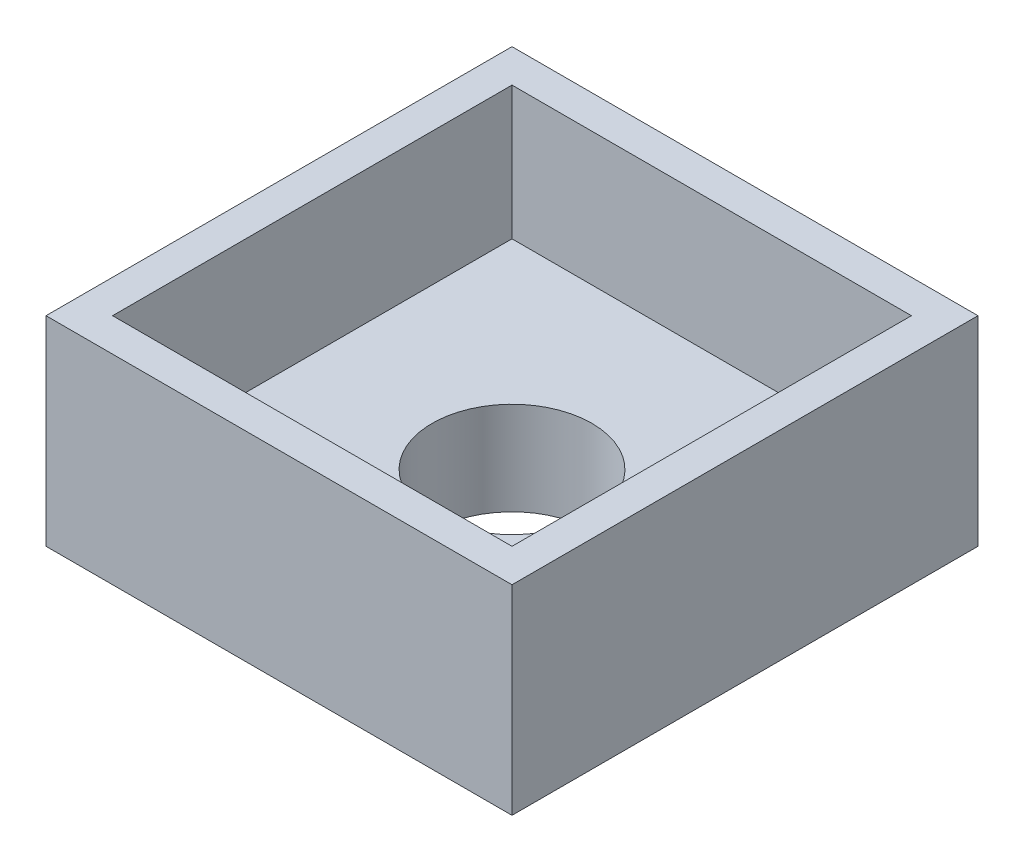
ISO-10303-21;
HEADER;
FILE_DESCRIPTION(('STEP AP214'),'2;1');
FILE_NAME('part.step','',(''),(''),'','','');
FILE_SCHEMA(('AUTOMOTIVE_DESIGN { 1 0 10303 214 1 1 1 1 }'));
ENDSEC;
DATA;
#1=APPLICATION_CONTEXT('core data for automotive mechanical design processes');
#2=APPLICATION_PROTOCOL_DEFINITION('international standard','automotive_design',2000,#1);
#3=PRODUCT_CONTEXT('',#1,'mechanical');
#4=PRODUCT('Part','Part','',(#3));
#5=PRODUCT_RELATED_PRODUCT_CATEGORY('part','',(#4));
#6=PRODUCT_DEFINITION_FORMATION('','',#4);
#7=PRODUCT_DEFINITION_CONTEXT('part definition',#1,'design');
#8=PRODUCT_DEFINITION('design','',#6,#7);
#9=PRODUCT_DEFINITION_SHAPE('','',#8);
#10=(LENGTH_UNIT() NAMED_UNIT(*) SI_UNIT(.MILLI.,.METRE.));
#11=(NAMED_UNIT(*) PLANE_ANGLE_UNIT() SI_UNIT($,.RADIAN.));
#12=(NAMED_UNIT(*) SI_UNIT($,.STERADIAN.) SOLID_ANGLE_UNIT());
#13=UNCERTAINTY_MEASURE_WITH_UNIT(LENGTH_MEASURE(1.E-05),#10,'distance_accuracy_value','');
#14=(GEOMETRIC_REPRESENTATION_CONTEXT(3) GLOBAL_UNCERTAINTY_ASSIGNED_CONTEXT((#13)) GLOBAL_UNIT_ASSIGNED_CONTEXT((#10,
#11,#12)) REPRESENTATION_CONTEXT('',''));
#15=CARTESIAN_POINT('',(0.,0.,0.));
#16=DIRECTION('',(0.,0.,1.));
#17=DIRECTION('',(1.,0.,0.));
#18=AXIS2_PLACEMENT_3D('',#15,#16,#17);
#19=CARTESIAN_POINT('',(0.,-5.,0.));
#20=DIRECTION('',(0.,1.,0.));
#21=DIRECTION('',(0.,0.,1.));
#22=AXIS2_PLACEMENT_3D('',#19,#20,#21);
#23=PLANE('',#22);
#24=DIRECTION('',(0.,0.,1.));
#25=VECTOR('',#24,1.);
#26=CARTESIAN_POINT('',(17.5,-5.,-17.5));
#27=LINE('',#26,#25);
#28=CARTESIAN_POINT('',(17.5,-5.,-17.5));
#29=VERTEX_POINT('',#28);
#30=CARTESIAN_POINT('',(17.5,-5.,17.5));
#31=VERTEX_POINT('',#30);
#32=EDGE_CURVE('E105',#29,#31,#27,.T.);
#33=ORIENTED_EDGE('',*,*,#32,.T.);
#34=DIRECTION('',(-1.,0.,0.));
#35=VECTOR('',#34,1.);
#36=CARTESIAN_POINT('',(-17.5,-5.,17.5));
#37=LINE('',#36,#35);
#38=CARTESIAN_POINT('',(-17.5,-5.,17.5));
#39=VERTEX_POINT('',#38);
#40=EDGE_CURVE('E114',#31,#39,#37,.T.);
#41=ORIENTED_EDGE('',*,*,#40,.T.);
#42=DIRECTION('',(0.,0.,-1.));
#43=VECTOR('',#42,1.);
#44=CARTESIAN_POINT('',(-17.5,-5.,-17.5));
#45=LINE('',#44,#43);
#46=CARTESIAN_POINT('',(-17.5,-5.,-17.5));
#47=VERTEX_POINT('',#46);
#48=EDGE_CURVE('E120',#39,#47,#45,.T.);
#49=ORIENTED_EDGE('',*,*,#48,.T.);
#50=DIRECTION('',(1.,0.,0.));
#51=VECTOR('',#50,1.);
#52=CARTESIAN_POINT('',(-17.5,-5.,-17.5));
#53=LINE('',#52,#51);
#54=EDGE_CURVE('E125',#47,#29,#53,.T.);
#55=ORIENTED_EDGE('',*,*,#54,.T.);
#56=EDGE_LOOP('',(#33,#41,#49,#55));
#57=FACE_BOUND('',#56,.T.);
#58=CARTESIAN_POINT('',(0.,-5.,0.));
#59=DIRECTION('',(0.,1.,0.));
#60=DIRECTION('',(0.,0.,1.));
#61=AXIS2_PLACEMENT_3D('',#58,#59,#60);
#62=CIRCLE('',#61,7.);
#63=CARTESIAN_POINT('',(0.,-5.,7.));
#64=VERTEX_POINT('',#63);
#65=EDGE_CURVE('E11',#64,#64,#62,.F.);
#66=ORIENTED_EDGE('',*,*,#65,.F.);
#67=EDGE_LOOP('',(#66));
#68=FACE_BOUND('',#67,.T.);
#69=ADVANCED_FACE('F33',(#57,#68),#23,.F.);
#70=CARTESIAN_POINT('',(0.,10.,0.));
#71=DIRECTION('',(0.,-1.,0.));
#72=DIRECTION('',(0.,0.,-1.));
#73=AXIS2_PLACEMENT_3D('',#70,#71,#72);
#74=PLANE('',#73);
#75=DIRECTION('',(0.,0.,-1.));
#76=VECTOR('',#75,1.);
#77=CARTESIAN_POINT('',(17.5,10.,17.5));
#78=LINE('',#77,#76);
#79=CARTESIAN_POINT('',(17.5,10.,17.5));
#80=VERTEX_POINT('',#79);
#81=CARTESIAN_POINT('',(17.5,10.,-17.5));
#82=VERTEX_POINT('',#81);
#83=EDGE_CURVE('E107',#80,#82,#78,.T.);
#84=ORIENTED_EDGE('',*,*,#83,.T.);
#85=DIRECTION('',(-1.,0.,0.));
#86=VECTOR('',#85,1.);
#87=CARTESIAN_POINT('',(-17.5,10.,-17.5));
#88=LINE('',#87,#86);
#89=CARTESIAN_POINT('',(-17.5,10.,-17.5));
#90=VERTEX_POINT('',#89);
#91=EDGE_CURVE('E161',#82,#90,#88,.T.);
#92=ORIENTED_EDGE('',*,*,#91,.T.);
#93=DIRECTION('',(0.,0.,1.));
#94=VECTOR('',#93,1.);
#95=CARTESIAN_POINT('',(-17.5,10.,17.5));
#96=LINE('',#95,#94);
#97=CARTESIAN_POINT('',(-17.5,10.,17.5));
#98=VERTEX_POINT('',#97);
#99=EDGE_CURVE('E163',#90,#98,#96,.T.);
#100=ORIENTED_EDGE('',*,*,#99,.T.);
#101=DIRECTION('',(1.,0.,0.));
#102=VECTOR('',#101,1.);
#103=CARTESIAN_POINT('',(-17.5,10.,17.5));
#104=LINE('',#103,#102);
#105=EDGE_CURVE('E111',#98,#80,#104,.T.);
#106=ORIENTED_EDGE('',*,*,#105,.T.);
#107=EDGE_LOOP('',(#84,#92,#100,#106));
#108=FACE_BOUND('',#107,.T.);
#109=DIRECTION('',(0.,0.,-1.));
#110=VECTOR('',#109,1.);
#111=CARTESIAN_POINT('',(15.,10.,15.));
#112=LINE('',#111,#110);
#113=CARTESIAN_POINT('',(15.,10.,15.));
#114=VERTEX_POINT('',#113);
#115=CARTESIAN_POINT('',(15.,10.,-15.));
#116=VERTEX_POINT('',#115);
#117=EDGE_CURVE('E135',#114,#116,#112,.T.);
#118=ORIENTED_EDGE('',*,*,#117,.F.);
#119=DIRECTION('',(1.,0.,0.));
#120=VECTOR('',#119,1.);
#121=CARTESIAN_POINT('',(-15.,10.,15.));
#122=LINE('',#121,#120);
#123=CARTESIAN_POINT('',(-15.,10.,15.));
#124=VERTEX_POINT('',#123);
#125=EDGE_CURVE('E142',#124,#114,#122,.T.);
#126=ORIENTED_EDGE('',*,*,#125,.F.);
#127=DIRECTION('',(0.,0.,1.));
#128=VECTOR('',#127,1.);
#129=CARTESIAN_POINT('',(-15.,10.,15.));
#130=LINE('',#129,#128);
#131=CARTESIAN_POINT('',(-15.,10.,-15.));
#132=VERTEX_POINT('',#131);
#133=EDGE_CURVE('E140',#132,#124,#130,.T.);
#134=ORIENTED_EDGE('',*,*,#133,.F.);
#135=DIRECTION('',(-1.,0.,0.));
#136=VECTOR('',#135,1.);
#137=CARTESIAN_POINT('',(-15.,10.,-15.));
#138=LINE('',#137,#136);
#139=EDGE_CURVE('E137',#116,#132,#138,.T.);
#140=ORIENTED_EDGE('',*,*,#139,.F.);
#141=EDGE_LOOP('',(#118,#126,#134,#140));
#142=FACE_BOUND('',#141,.T.);
#143=ADVANCED_FACE('F173',(#108,#142),#74,.F.);
#144=CARTESIAN_POINT('',(17.5,10.,17.5));
#145=DIRECTION('',(-1.,0.,0.));
#146=DIRECTION('',(0.,0.,1.));
#147=AXIS2_PLACEMENT_3D('',#144,#145,#146);
#148=PLANE('',#147);
#149=DIRECTION('',(0.,-1.,0.));
#150=VECTOR('',#149,1.);
#151=CARTESIAN_POINT('',(17.5,10.,17.5));
#152=LINE('',#151,#150);
#153=EDGE_CURVE('E101',#80,#31,#152,.T.);
#154=ORIENTED_EDGE('',*,*,#153,.T.);
#155=ORIENTED_EDGE('',*,*,#32,.F.);
#156=DIRECTION('',(0.,-1.,0.));
#157=VECTOR('',#156,1.);
#158=CARTESIAN_POINT('',(17.5,10.,-17.5));
#159=LINE('',#158,#157);
#160=EDGE_CURVE('E41',#82,#29,#159,.T.);
#161=ORIENTED_EDGE('',*,*,#160,.F.);
#162=ORIENTED_EDGE('',*,*,#83,.F.);
#163=EDGE_LOOP('',(#154,#155,#161,#162));
#164=FACE_BOUND('',#163,.T.);
#165=ADVANCED_FACE('F35',(#164),#148,.F.);
#166=CARTESIAN_POINT('',(-17.5,10.,-17.5));
#167=DIRECTION('',(0.,0.,1.));
#168=DIRECTION('',(1.,0.,0.));
#169=AXIS2_PLACEMENT_3D('',#166,#167,#168);
#170=PLANE('',#169);
#171=ORIENTED_EDGE('',*,*,#160,.T.);
#172=ORIENTED_EDGE('',*,*,#54,.F.);
#173=DIRECTION('',(0.,-1.,0.));
#174=VECTOR('',#173,1.);
#175=CARTESIAN_POINT('',(-17.5,10.,-17.5));
#176=LINE('',#175,#174);
#177=EDGE_CURVE('E167',#90,#47,#176,.T.);
#178=ORIENTED_EDGE('',*,*,#177,.F.);
#179=ORIENTED_EDGE('',*,*,#91,.F.);
#180=EDGE_LOOP('',(#171,#172,#178,#179));
#181=FACE_BOUND('',#180,.T.);
#182=ADVANCED_FACE('F169',(#181),#170,.F.);
#183=CARTESIAN_POINT('',(-17.5,10.,17.5));
#184=DIRECTION('',(1.,0.,0.));
#185=DIRECTION('',(0.,0.,-1.));
#186=AXIS2_PLACEMENT_3D('',#183,#184,#185);
#187=PLANE('',#186);
#188=ORIENTED_EDGE('',*,*,#177,.T.);
#189=ORIENTED_EDGE('',*,*,#48,.F.);
#190=DIRECTION('',(0.,-1.,0.));
#191=VECTOR('',#190,1.);
#192=CARTESIAN_POINT('',(-17.5,10.,17.5));
#193=LINE('',#192,#191);
#194=EDGE_CURVE('E110',#98,#39,#193,.T.);
#195=ORIENTED_EDGE('',*,*,#194,.F.);
#196=ORIENTED_EDGE('',*,*,#99,.F.);
#197=EDGE_LOOP('',(#188,#189,#195,#196));
#198=FACE_BOUND('',#197,.T.);
#199=ADVANCED_FACE('F176',(#198),#187,.F.);
#200=CARTESIAN_POINT('',(-17.5,10.,17.5));
#201=DIRECTION('',(0.,0.,-1.));
#202=DIRECTION('',(-1.,0.,0.));
#203=AXIS2_PLACEMENT_3D('',#200,#201,#202);
#204=PLANE('',#203);
#205=ORIENTED_EDGE('',*,*,#194,.T.);
#206=ORIENTED_EDGE('',*,*,#40,.F.);
#207=ORIENTED_EDGE('',*,*,#153,.F.);
#208=ORIENTED_EDGE('',*,*,#105,.F.);
#209=EDGE_LOOP('',(#205,#206,#207,#208));
#210=FACE_BOUND('',#209,.T.);
#211=ADVANCED_FACE('F115',(#210),#204,.F.);
#212=CARTESIAN_POINT('',(15.,10.,15.));
#213=DIRECTION('',(-1.,0.,0.));
#214=DIRECTION('',(0.,0.,1.));
#215=AXIS2_PLACEMENT_3D('',#212,#213,#214);
#216=PLANE('',#215);
#217=DIRECTION('',(0.,0.,-1.));
#218=VECTOR('',#217,1.);
#219=CARTESIAN_POINT('',(15.,0.,15.));
#220=LINE('',#219,#218);
#221=CARTESIAN_POINT('',(15.,0.,15.));
#222=VERTEX_POINT('',#221);
#223=CARTESIAN_POINT('',(15.,0.,-15.));
#224=VERTEX_POINT('',#223);
#225=EDGE_CURVE('E56',#222,#224,#220,.T.);
#226=ORIENTED_EDGE('',*,*,#225,.F.);
#227=DIRECTION('',(0.,-1.,0.));
#228=VECTOR('',#227,1.);
#229=CARTESIAN_POINT('',(15.,10.,15.));
#230=LINE('',#229,#228);
#231=EDGE_CURVE('E144',#114,#222,#230,.T.);
#232=ORIENTED_EDGE('',*,*,#231,.F.);
#233=ORIENTED_EDGE('',*,*,#117,.T.);
#234=DIRECTION('',(0.,-1.,0.));
#235=VECTOR('',#234,1.);
#236=CARTESIAN_POINT('',(15.,10.,-15.));
#237=LINE('',#236,#235);
#238=EDGE_CURVE('E158',#116,#224,#237,.T.);
#239=ORIENTED_EDGE('',*,*,#238,.T.);
#240=EDGE_LOOP('',(#226,#232,#233,#239));
#241=FACE_BOUND('',#240,.T.);
#242=ADVANCED_FACE('F183',(#241),#216,.T.);
#243=CARTESIAN_POINT('',(-15.,10.,-15.));
#244=DIRECTION('',(0.,0.,1.));
#245=DIRECTION('',(1.,0.,0.));
#246=AXIS2_PLACEMENT_3D('',#243,#244,#245);
#247=PLANE('',#246);
#248=DIRECTION('',(-1.,0.,0.));
#249=VECTOR('',#248,1.);
#250=CARTESIAN_POINT('',(-15.,0.,-15.));
#251=LINE('',#250,#249);
#252=CARTESIAN_POINT('',(-15.,0.,-15.));
#253=VERTEX_POINT('',#252);
#254=EDGE_CURVE('E146',#224,#253,#251,.T.);
#255=ORIENTED_EDGE('',*,*,#254,.F.);
#256=ORIENTED_EDGE('',*,*,#238,.F.);
#257=ORIENTED_EDGE('',*,*,#139,.T.);
#258=DIRECTION('',(0.,-1.,0.));
#259=VECTOR('',#258,1.);
#260=CARTESIAN_POINT('',(-15.,10.,-15.));
#261=LINE('',#260,#259);
#262=EDGE_CURVE('E156',#132,#253,#261,.T.);
#263=ORIENTED_EDGE('',*,*,#262,.T.);
#264=EDGE_LOOP('',(#255,#256,#257,#263));
#265=FACE_BOUND('',#264,.T.);
#266=ADVANCED_FACE('F205',(#265),#247,.T.);
#267=CARTESIAN_POINT('',(-15.,10.,15.));
#268=DIRECTION('',(1.,0.,0.));
#269=DIRECTION('',(0.,0.,-1.));
#270=AXIS2_PLACEMENT_3D('',#267,#268,#269);
#271=PLANE('',#270);
#272=DIRECTION('',(0.,0.,1.));
#273=VECTOR('',#272,1.);
#274=CARTESIAN_POINT('',(-15.,0.,15.));
#275=LINE('',#274,#273);
#276=CARTESIAN_POINT('',(-15.,0.,15.));
#277=VERTEX_POINT('',#276);
#278=EDGE_CURVE('E149',#253,#277,#275,.T.);
#279=ORIENTED_EDGE('',*,*,#278,.F.);
#280=ORIENTED_EDGE('',*,*,#262,.F.);
#281=ORIENTED_EDGE('',*,*,#133,.T.);
#282=DIRECTION('',(0.,-1.,0.));
#283=VECTOR('',#282,1.);
#284=CARTESIAN_POINT('',(-15.,10.,15.));
#285=LINE('',#284,#283);
#286=EDGE_CURVE('E48',#124,#277,#285,.T.);
#287=ORIENTED_EDGE('',*,*,#286,.T.);
#288=EDGE_LOOP('',(#279,#280,#281,#287));
#289=FACE_BOUND('',#288,.T.);
#290=ADVANCED_FACE('F202',(#289),#271,.T.);
#291=CARTESIAN_POINT('',(-15.,10.,15.));
#292=DIRECTION('',(0.,0.,-1.));
#293=DIRECTION('',(-1.,0.,0.));
#294=AXIS2_PLACEMENT_3D('',#291,#292,#293);
#295=PLANE('',#294);
#296=DIRECTION('',(1.,0.,0.));
#297=VECTOR('',#296,1.);
#298=CARTESIAN_POINT('',(-15.,0.,15.));
#299=LINE('',#298,#297);
#300=EDGE_CURVE('E138',#277,#222,#299,.T.);
#301=ORIENTED_EDGE('',*,*,#300,.F.);
#302=ORIENTED_EDGE('',*,*,#286,.F.);
#303=ORIENTED_EDGE('',*,*,#125,.T.);
#304=ORIENTED_EDGE('',*,*,#231,.T.);
#305=EDGE_LOOP('',(#301,#302,#303,#304));
#306=FACE_BOUND('',#305,.T.);
#307=ADVANCED_FACE('F198',(#306),#295,.T.);
#308=CARTESIAN_POINT('',(0.,0.,0.));
#309=DIRECTION('',(0.,1.,0.));
#310=DIRECTION('',(0.,0.,1.));
#311=AXIS2_PLACEMENT_3D('',#308,#309,#310);
#312=PLANE('',#311);
#313=CARTESIAN_POINT('',(0.,0.,0.));
#314=DIRECTION('',(0.,1.,0.));
#315=DIRECTION('',(0.,0.,1.));
#316=AXIS2_PLACEMENT_3D('',#313,#314,#315);
#317=CIRCLE('',#316,6.);
#318=CARTESIAN_POINT('',(0.,0.,6.));
#319=VERTEX_POINT('',#318);
#320=EDGE_CURVE('E126',#319,#319,#317,.T.);
#321=ORIENTED_EDGE('',*,*,#320,.F.);
#322=EDGE_LOOP('',(#321));
#323=FACE_BOUND('',#322,.T.);
#324=ORIENTED_EDGE('',*,*,#278,.T.);
#325=ORIENTED_EDGE('',*,*,#300,.T.);
#326=ORIENTED_EDGE('',*,*,#225,.T.);
#327=ORIENTED_EDGE('',*,*,#254,.T.);
#328=EDGE_LOOP('',(#324,#325,#326,#327));
#329=FACE_BOUND('',#328,.T.);
#330=ADVANCED_FACE('F195',(#323,#329),#312,.T.);
#331=CARTESIAN_POINT('',(0.,10.,0.));
#332=DIRECTION('',(0.,-1.,0.));
#333=DIRECTION('',(0.,0.,-1.));
#334=AXIS2_PLACEMENT_3D('',#331,#332,#333);
#335=CYLINDRICAL_SURFACE('',#334,6.);
#336=ORIENTED_EDGE('',*,*,#320,.T.);
#337=EDGE_LOOP('',(#336));
#338=FACE_BOUND('',#337,.T.);
#339=CARTESIAN_POINT('',(0.,-7.,0.));
#340=DIRECTION('',(0.,-1.,0.));
#341=DIRECTION('',(0.,0.,-1.));
#342=AXIS2_PLACEMENT_3D('',#339,#340,#341);
#343=CIRCLE('',#342,6.);
#344=CARTESIAN_POINT('',(0.,-7.,-6.));
#345=VERTEX_POINT('',#344);
#346=EDGE_CURVE('E320',#345,#345,#343,.T.);
#347=ORIENTED_EDGE('',*,*,#346,.T.);
#348=EDGE_LOOP('',(#347));
#349=FACE_BOUND('',#348,.T.);
#350=ADVANCED_FACE('F193',(#338,#349),#335,.F.);
#351=CARTESIAN_POINT('',(0.,-7.,0.));
#352=DIRECTION('',(0.,-1.,0.));
#353=DIRECTION('',(0.,0.,-1.));
#354=AXIS2_PLACEMENT_3D('',#351,#352,#353);
#355=PLANE('',#354);
#356=CARTESIAN_POINT('',(0.,-7.,0.));
#357=DIRECTION('',(0.,-1.,0.));
#358=DIRECTION('',(0.,0.,-1.));
#359=AXIS2_PLACEMENT_3D('',#356,#357,#358);
#360=CIRCLE('',#359,7.);
#361=CARTESIAN_POINT('',(0.,-7.,-7.));
#362=VERTEX_POINT('',#361);
#363=EDGE_CURVE('E129',#362,#362,#360,.T.);
#364=ORIENTED_EDGE('',*,*,#363,.T.);
#365=EDGE_LOOP('',(#364));
#366=FACE_BOUND('',#365,.T.);
#367=ORIENTED_EDGE('',*,*,#346,.F.);
#368=EDGE_LOOP('',(#367));
#369=FACE_BOUND('',#368,.T.);
#370=ADVANCED_FACE('F237',(#366,#369),#355,.T.);
#371=CARTESIAN_POINT('',(0.,-7.,0.));
#372=DIRECTION('',(0.,1.,0.));
#373=DIRECTION('',(0.,0.,1.));
#374=AXIS2_PLACEMENT_3D('',#371,#372,#373);
#375=CYLINDRICAL_SURFACE('',#374,7.);
#376=ORIENTED_EDGE('',*,*,#363,.F.);
#377=EDGE_LOOP('',(#376));
#378=FACE_BOUND('',#377,.T.);
#379=ORIENTED_EDGE('',*,*,#65,.T.);
#380=EDGE_LOOP('',(#379));
#381=FACE_BOUND('',#380,.T.);
#382=ADVANCED_FACE('F244',(#378,#381),#375,.T.);
#383=CLOSED_SHELL('',(#69,#143,#165,#182,#199,#211,#242,#266,#290,#307,#330,#350,#370,#382));
#384=MANIFOLD_SOLID_BREP('B2',#383);
#385=ADVANCED_BREP_SHAPE_REPRESENTATION('',(#18,#384),#14);
#386=SHAPE_DEFINITION_REPRESENTATION(#9,#385);
ENDSEC;
END-ISO-10303-21;
